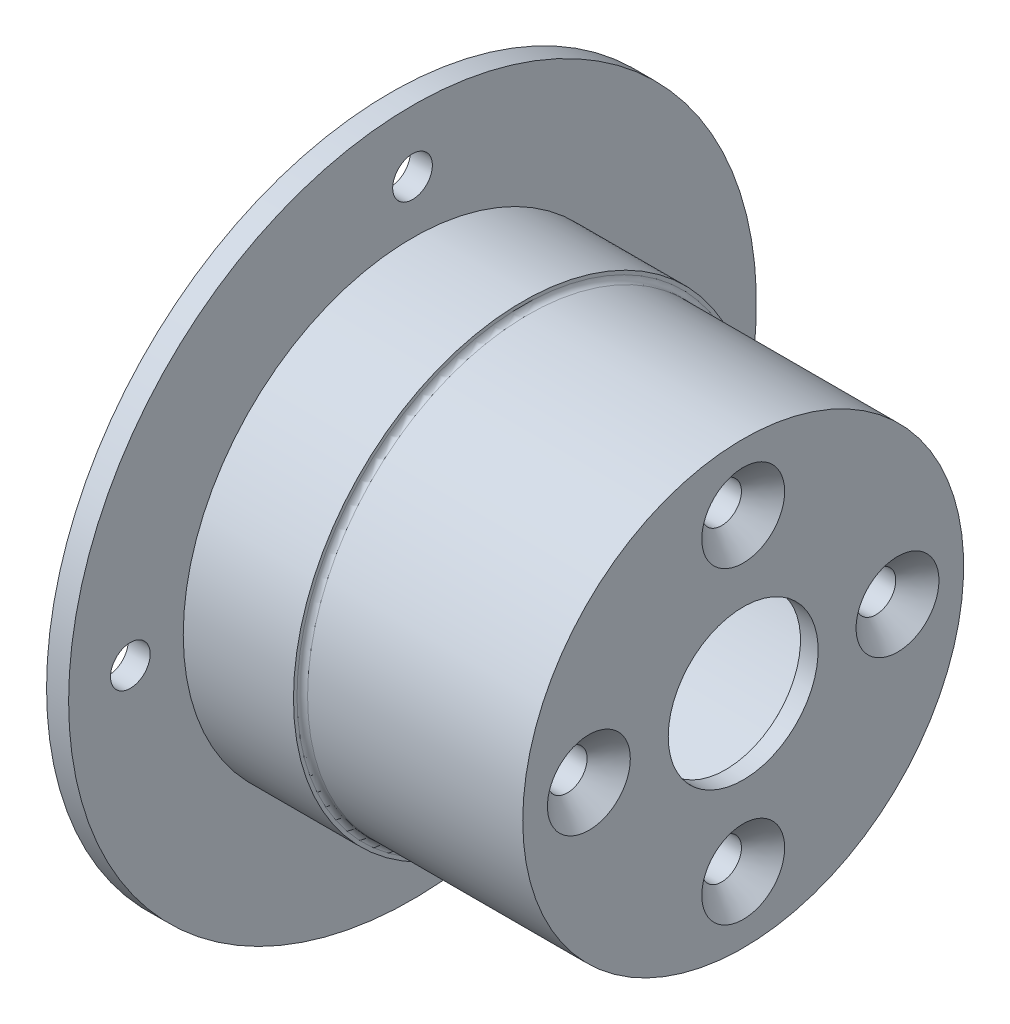
ISO-10303-21;
HEADER;
FILE_DESCRIPTION(('STEP AP214'),'2;1');
FILE_NAME('part.step','',(''),(''),'','','');
FILE_SCHEMA(('AUTOMOTIVE_DESIGN { 1 0 10303 214 1 1 1 1 }'));
ENDSEC;
DATA;
#1=APPLICATION_CONTEXT('core data for automotive mechanical design processes');
#2=APPLICATION_PROTOCOL_DEFINITION('international standard','automotive_design',2000,#1);
#3=PRODUCT_CONTEXT('',#1,'mechanical');
#4=PRODUCT('Part','Part','',(#3));
#5=PRODUCT_RELATED_PRODUCT_CATEGORY('part','',(#4));
#6=PRODUCT_DEFINITION_FORMATION('','',#4);
#7=PRODUCT_DEFINITION_CONTEXT('part definition',#1,'design');
#8=PRODUCT_DEFINITION('design','',#6,#7);
#9=PRODUCT_DEFINITION_SHAPE('','',#8);
#10=(LENGTH_UNIT() NAMED_UNIT(*) SI_UNIT(.MILLI.,.METRE.));
#11=(NAMED_UNIT(*) PLANE_ANGLE_UNIT() SI_UNIT($,.RADIAN.));
#12=(NAMED_UNIT(*) SI_UNIT($,.STERADIAN.) SOLID_ANGLE_UNIT());
#13=UNCERTAINTY_MEASURE_WITH_UNIT(LENGTH_MEASURE(1.E-05),#10,'distance_accuracy_value','');
#14=(GEOMETRIC_REPRESENTATION_CONTEXT(3) GLOBAL_UNCERTAINTY_ASSIGNED_CONTEXT((#13)) GLOBAL_UNIT_ASSIGNED_CONTEXT((#10,
#11,#12)) REPRESENTATION_CONTEXT('',''));
#15=CARTESIAN_POINT('',(0.,0.,0.));
#16=DIRECTION('',(0.,0.,1.));
#17=DIRECTION('',(1.,0.,0.));
#18=AXIS2_PLACEMENT_3D('',#15,#16,#17);
#19=CARTESIAN_POINT('',(0.,39.,0.));
#20=DIRECTION('',(1.,0.,0.));
#21=DIRECTION('',(0.,0.,-1.));
#22=AXIS2_PLACEMENT_3D('',#19,#20,#21);
#23=PLANE('',#22);
#24=CARTESIAN_POINT('',(0.,-32.,0.));
#25=DIRECTION('',(-1.,0.,0.));
#26=DIRECTION('',(0.,0.,1.));
#27=AXIS2_PLACEMENT_3D('',#24,#25,#26);
#28=CIRCLE('',#27,2.25);
#29=CARTESIAN_POINT('',(0.,-32.,2.25));
#30=VERTEX_POINT('',#29);
#31=EDGE_CURVE('E170',#30,#30,#28,.T.);
#32=ORIENTED_EDGE('',*,*,#31,.F.);
#33=EDGE_LOOP('',(#32));
#34=FACE_BOUND('',#33,.T.);
#35=CARTESIAN_POINT('',(0.,0.,32.));
#36=DIRECTION('',(-1.,0.,0.));
#37=DIRECTION('',(0.,0.,1.));
#38=AXIS2_PLACEMENT_3D('',#35,#36,#37);
#39=CIRCLE('',#38,2.25);
#40=CARTESIAN_POINT('',(0.,0.,34.25));
#41=VERTEX_POINT('',#40);
#42=EDGE_CURVE('E163',#41,#41,#39,.T.);
#43=ORIENTED_EDGE('',*,*,#42,.F.);
#44=EDGE_LOOP('',(#43));
#45=FACE_BOUND('',#44,.T.);
#46=CARTESIAN_POINT('',(0.,0.,-32.));
#47=DIRECTION('',(-1.,0.,0.));
#48=DIRECTION('',(0.,0.,1.));
#49=AXIS2_PLACEMENT_3D('',#46,#47,#48);
#50=CIRCLE('',#49,2.25);
#51=CARTESIAN_POINT('',(0.,0.,-29.75));
#52=VERTEX_POINT('',#51);
#53=EDGE_CURVE('E155',#52,#52,#50,.T.);
#54=ORIENTED_EDGE('',*,*,#53,.F.);
#55=EDGE_LOOP('',(#54));
#56=FACE_BOUND('',#55,.T.);
#57=CARTESIAN_POINT('',(0.,0.,0.));
#58=DIRECTION('',(-1.,0.,0.));
#59=DIRECTION('',(0.,0.,1.));
#60=AXIS2_PLACEMENT_3D('',#57,#58,#59);
#61=CIRCLE('',#60,21.);
#62=CARTESIAN_POINT('',(0.,0.,21.));
#63=VERTEX_POINT('',#62);
#64=EDGE_CURVE('E55',#63,#63,#61,.T.);
#65=ORIENTED_EDGE('',*,*,#64,.F.);
#66=EDGE_LOOP('',(#65));
#67=FACE_BOUND('',#66,.T.);
#68=CARTESIAN_POINT('',(0.,0.,0.));
#69=DIRECTION('',(-1.,0.,0.));
#70=DIRECTION('',(0.,0.,1.));
#71=AXIS2_PLACEMENT_3D('',#68,#69,#70);
#72=CIRCLE('',#71,39.);
#73=CARTESIAN_POINT('',(0.,0.,39.));
#74=VERTEX_POINT('',#73);
#75=EDGE_CURVE('E99',#74,#74,#72,.T.);
#76=ORIENTED_EDGE('',*,*,#75,.T.);
#77=EDGE_LOOP('',(#76));
#78=FACE_BOUND('',#77,.T.);
#79=CARTESIAN_POINT('',(0.,32.,0.));
#80=DIRECTION('',(-1.,0.,0.));
#81=DIRECTION('',(0.,0.,1.));
#82=AXIS2_PLACEMENT_3D('',#79,#80,#81);
#83=CIRCLE('',#82,2.25);
#84=CARTESIAN_POINT('',(0.,32.,2.25));
#85=VERTEX_POINT('',#84);
#86=EDGE_CURVE('E176',#85,#85,#83,.T.);
#87=ORIENTED_EDGE('',*,*,#86,.F.);
#88=EDGE_LOOP('',(#87));
#89=FACE_BOUND('',#88,.T.);
#90=ADVANCED_FACE('F40',(#34,#45,#56,#67,#78,#89),#23,.F.);
#91=CARTESIAN_POINT('',(-64.1033524540557,0.,0.));
#92=DIRECTION('',(-1.,0.,0.));
#93=DIRECTION('',(0.,0.,1.));
#94=AXIS2_PLACEMENT_3D('',#91,#92,#93);
#95=CYLINDRICAL_SURFACE('',#94,21.);
#96=CARTESIAN_POINT('',(35.,0.,0.));
#97=DIRECTION('',(-1.,0.,0.));
#98=DIRECTION('',(0.,0.,1.));
#99=AXIS2_PLACEMENT_3D('',#96,#97,#98);
#100=CIRCLE('',#99,21.);
#101=CARTESIAN_POINT('',(35.,0.,21.));
#102=VERTEX_POINT('',#101);
#103=EDGE_CURVE('E62',#102,#102,#100,.T.);
#104=ORIENTED_EDGE('',*,*,#103,.F.);
#105=EDGE_LOOP('',(#104));
#106=FACE_BOUND('',#105,.T.);
#107=ORIENTED_EDGE('',*,*,#64,.T.);
#108=EDGE_LOOP('',(#107));
#109=FACE_BOUND('',#108,.T.);
#110=ADVANCED_FACE('F184',(#106,#109),#95,.F.);
#111=CARTESIAN_POINT('',(35.,21.,0.));
#112=DIRECTION('',(1.,0.,0.));
#113=DIRECTION('',(0.,0.,-1.));
#114=AXIS2_PLACEMENT_3D('',#111,#112,#113);
#115=PLANE('',#114);
#116=CARTESIAN_POINT('',(35.,17.5,0.));
#117=DIRECTION('',(1.,0.,0.));
#118=DIRECTION('',(0.,0.,-1.));
#119=AXIS2_PLACEMENT_3D('',#116,#117,#118);
#120=CIRCLE('',#119,2.24999999999999);
#121=CARTESIAN_POINT('',(35.,17.5,-2.24999999999999));
#122=VERTEX_POINT('',#121);
#123=EDGE_CURVE('E139',#122,#122,#120,.T.);
#124=ORIENTED_EDGE('',*,*,#123,.T.);
#125=EDGE_LOOP('',(#124));
#126=FACE_BOUND('',#125,.T.);
#127=CARTESIAN_POINT('',(35.,0.,-17.5));
#128=DIRECTION('',(1.,0.,0.));
#129=DIRECTION('',(0.,0.,-1.));
#130=AXIS2_PLACEMENT_3D('',#127,#128,#129);
#131=CIRCLE('',#130,2.24999999999999);
#132=CARTESIAN_POINT('',(35.,0.,-19.75));
#133=VERTEX_POINT('',#132);
#134=EDGE_CURVE('E127',#133,#133,#131,.T.);
#135=ORIENTED_EDGE('',*,*,#134,.T.);
#136=EDGE_LOOP('',(#135));
#137=FACE_BOUND('',#136,.T.);
#138=CARTESIAN_POINT('',(35.,-17.5,0.));
#139=DIRECTION('',(1.,0.,0.));
#140=DIRECTION('',(0.,0.,-1.));
#141=AXIS2_PLACEMENT_3D('',#138,#139,#140);
#142=CIRCLE('',#141,2.24999999999999);
#143=CARTESIAN_POINT('',(35.,-17.5,-2.24999999999999));
#144=VERTEX_POINT('',#143);
#145=EDGE_CURVE('E115',#144,#144,#142,.T.);
#146=ORIENTED_EDGE('',*,*,#145,.T.);
#147=EDGE_LOOP('',(#146));
#148=FACE_BOUND('',#147,.T.);
#149=CARTESIAN_POINT('',(35.,0.,17.5));
#150=DIRECTION('',(1.,0.,0.));
#151=DIRECTION('',(0.,0.,-1.));
#152=AXIS2_PLACEMENT_3D('',#149,#150,#151);
#153=CIRCLE('',#152,2.24999999999999);
#154=CARTESIAN_POINT('',(35.,0.,15.25));
#155=VERTEX_POINT('',#154);
#156=EDGE_CURVE('E103',#155,#155,#153,.T.);
#157=ORIENTED_EDGE('',*,*,#156,.T.);
#158=EDGE_LOOP('',(#157));
#159=FACE_BOUND('',#158,.T.);
#160=CARTESIAN_POINT('',(35.,0.,0.));
#161=DIRECTION('',(-1.,0.,0.));
#162=DIRECTION('',(0.,0.,1.));
#163=AXIS2_PLACEMENT_3D('',#160,#161,#162);
#164=CIRCLE('',#163,12.75);
#165=CARTESIAN_POINT('',(35.,0.,12.75));
#166=VERTEX_POINT('',#165);
#167=EDGE_CURVE('E68',#166,#166,#164,.T.);
#168=ORIENTED_EDGE('',*,*,#167,.F.);
#169=EDGE_LOOP('',(#168));
#170=FACE_BOUND('',#169,.T.);
#171=ORIENTED_EDGE('',*,*,#103,.T.);
#172=EDGE_LOOP('',(#171));
#173=FACE_BOUND('',#172,.T.);
#174=ADVANCED_FACE('F190',(#126,#137,#148,#159,#170,#173),#115,.F.);
#175=CARTESIAN_POINT('',(-64.1033524540557,0.,0.));
#176=DIRECTION('',(-1.,0.,0.));
#177=DIRECTION('',(0.,0.,1.));
#178=AXIS2_PLACEMENT_3D('',#175,#176,#177);
#179=CYLINDRICAL_SURFACE('',#178,12.75);
#180=CARTESIAN_POINT('',(38.,0.,0.));
#181=DIRECTION('',(-1.,0.,0.));
#182=DIRECTION('',(0.,0.,1.));
#183=AXIS2_PLACEMENT_3D('',#180,#181,#182);
#184=CIRCLE('',#183,12.75);
#185=CARTESIAN_POINT('',(38.,0.,12.75));
#186=VERTEX_POINT('',#185);
#187=EDGE_CURVE('E72',#186,#186,#184,.T.);
#188=ORIENTED_EDGE('',*,*,#187,.F.);
#189=EDGE_LOOP('',(#188));
#190=FACE_BOUND('',#189,.T.);
#191=ORIENTED_EDGE('',*,*,#167,.T.);
#192=EDGE_LOOP('',(#191));
#193=FACE_BOUND('',#192,.T.);
#194=ADVANCED_FACE('F227',(#190,#193),#179,.F.);
#195=CARTESIAN_POINT('',(38.,12.75,0.));
#196=DIRECTION('',(1.,0.,0.));
#197=DIRECTION('',(0.,0.,-1.));
#198=AXIS2_PLACEMENT_3D('',#195,#196,#197);
#199=PLANE('',#198);
#200=CARTESIAN_POINT('',(38.,0.,0.));
#201=DIRECTION('',(-1.,0.,0.));
#202=DIRECTION('',(0.,0.,1.));
#203=AXIS2_PLACEMENT_3D('',#200,#201,#202);
#204=CIRCLE('',#203,8.5);
#205=CARTESIAN_POINT('',(38.,0.,8.5));
#206=VERTEX_POINT('',#205);
#207=EDGE_CURVE('E76',#206,#206,#204,.T.);
#208=ORIENTED_EDGE('',*,*,#207,.F.);
#209=EDGE_LOOP('',(#208));
#210=FACE_BOUND('',#209,.T.);
#211=ORIENTED_EDGE('',*,*,#187,.T.);
#212=EDGE_LOOP('',(#211));
#213=FACE_BOUND('',#212,.T.);
#214=ADVANCED_FACE('F223',(#210,#213),#199,.F.);
#215=CARTESIAN_POINT('',(-64.1033524540557,0.,0.));
#216=DIRECTION('',(-1.,0.,0.));
#217=DIRECTION('',(0.,0.,1.));
#218=AXIS2_PLACEMENT_3D('',#215,#216,#217);
#219=CYLINDRICAL_SURFACE('',#218,8.5);
#220=CARTESIAN_POINT('',(40.,0.,0.));
#221=DIRECTION('',(-1.,0.,0.));
#222=DIRECTION('',(0.,0.,1.));
#223=AXIS2_PLACEMENT_3D('',#220,#221,#222);
#224=CIRCLE('',#223,8.5);
#225=CARTESIAN_POINT('',(40.,0.,8.5));
#226=VERTEX_POINT('',#225);
#227=EDGE_CURVE('E79',#226,#226,#224,.T.);
#228=ORIENTED_EDGE('',*,*,#227,.F.);
#229=EDGE_LOOP('',(#228));
#230=FACE_BOUND('',#229,.T.);
#231=ORIENTED_EDGE('',*,*,#207,.T.);
#232=EDGE_LOOP('',(#231));
#233=FACE_BOUND('',#232,.T.);
#234=ADVANCED_FACE('F219',(#230,#233),#219,.F.);
#235=CARTESIAN_POINT('',(40.,8.5,0.));
#236=DIRECTION('',(-1.,0.,0.));
#237=DIRECTION('',(0.,0.,1.));
#238=AXIS2_PLACEMENT_3D('',#235,#236,#237);
#239=PLANE('',#238);
#240=CARTESIAN_POINT('',(40.,17.5,0.));
#241=DIRECTION('',(1.,0.,0.));
#242=DIRECTION('',(0.,0.,-1.));
#243=AXIS2_PLACEMENT_3D('',#240,#241,#242);
#244=CIRCLE('',#243,4.7);
#245=CARTESIAN_POINT('',(40.,17.5,-4.7));
#246=VERTEX_POINT('',#245);
#247=EDGE_CURVE('E147',#246,#246,#244,.T.);
#248=ORIENTED_EDGE('',*,*,#247,.F.);
#249=EDGE_LOOP('',(#248));
#250=FACE_BOUND('',#249,.T.);
#251=CARTESIAN_POINT('',(40.,0.,-17.5));
#252=DIRECTION('',(1.,0.,0.));
#253=DIRECTION('',(0.,0.,-1.));
#254=AXIS2_PLACEMENT_3D('',#251,#252,#253);
#255=CIRCLE('',#254,4.7);
#256=CARTESIAN_POINT('',(40.,0.,-22.2));
#257=VERTEX_POINT('',#256);
#258=EDGE_CURVE('E135',#257,#257,#255,.T.);
#259=ORIENTED_EDGE('',*,*,#258,.F.);
#260=EDGE_LOOP('',(#259));
#261=FACE_BOUND('',#260,.T.);
#262=CARTESIAN_POINT('',(40.,-17.5,0.));
#263=DIRECTION('',(1.,0.,0.));
#264=DIRECTION('',(0.,0.,-1.));
#265=AXIS2_PLACEMENT_3D('',#262,#263,#264);
#266=CIRCLE('',#265,4.7);
#267=CARTESIAN_POINT('',(40.,-17.5,-4.7));
#268=VERTEX_POINT('',#267);
#269=EDGE_CURVE('E123',#268,#268,#266,.T.);
#270=ORIENTED_EDGE('',*,*,#269,.F.);
#271=EDGE_LOOP('',(#270));
#272=FACE_BOUND('',#271,.T.);
#273=CARTESIAN_POINT('',(40.,0.,17.5));
#274=DIRECTION('',(1.,0.,0.));
#275=DIRECTION('',(0.,0.,-1.));
#276=AXIS2_PLACEMENT_3D('',#273,#274,#275);
#277=CIRCLE('',#276,4.7);
#278=CARTESIAN_POINT('',(40.,0.,12.8));
#279=VERTEX_POINT('',#278);
#280=EDGE_CURVE('E111',#279,#279,#277,.T.);
#281=ORIENTED_EDGE('',*,*,#280,.F.);
#282=EDGE_LOOP('',(#281));
#283=FACE_BOUND('',#282,.T.);
#284=CARTESIAN_POINT('',(40.,0.,0.));
#285=DIRECTION('',(-1.,0.,0.));
#286=DIRECTION('',(0.,0.,1.));
#287=AXIS2_PLACEMENT_3D('',#284,#285,#286);
#288=CIRCLE('',#287,25.);
#289=CARTESIAN_POINT('',(40.,0.,25.));
#290=VERTEX_POINT('',#289);
#291=EDGE_CURVE('E83',#290,#290,#288,.T.);
#292=ORIENTED_EDGE('',*,*,#291,.F.);
#293=EDGE_LOOP('',(#292));
#294=FACE_BOUND('',#293,.T.);
#295=ORIENTED_EDGE('',*,*,#227,.T.);
#296=EDGE_LOOP('',(#295));
#297=FACE_BOUND('',#296,.T.);
#298=ADVANCED_FACE('F216',(#250,#261,#272,#283,#294,#297),#239,.F.);
#299=CARTESIAN_POINT('',(-64.1033524540557,0.,0.));
#300=DIRECTION('',(-1.,0.,0.));
#301=DIRECTION('',(0.,0.,1.));
#302=AXIS2_PLACEMENT_3D('',#299,#300,#301);
#303=CYLINDRICAL_SURFACE('',#302,25.);
#304=CARTESIAN_POINT('',(15.6,0.,0.));
#305=DIRECTION('',(-1.,0.,0.));
#306=DIRECTION('',(0.,0.,1.));
#307=AXIS2_PLACEMENT_3D('',#304,#305,#306);
#308=CIRCLE('',#307,25.);
#309=CARTESIAN_POINT('',(15.6,0.,25.));
#310=VERTEX_POINT('',#309);
#311=EDGE_CURVE('E10',#310,#310,#308,.F.);
#312=ORIENTED_EDGE('',*,*,#311,.T.);
#313=EDGE_LOOP('',(#312));
#314=FACE_BOUND('',#313,.T.);
#315=ORIENTED_EDGE('',*,*,#291,.T.);
#316=EDGE_LOOP('',(#315));
#317=FACE_BOUND('',#316,.T.);
#318=ADVANCED_FACE('F213',(#314,#317),#303,.T.);
#319=CARTESIAN_POINT('',(15.,25.,0.));
#320=DIRECTION('',(-1.,0.,0.));
#321=DIRECTION('',(0.,0.,1.));
#322=AXIS2_PLACEMENT_3D('',#319,#320,#321);
#323=PLANE('',#322);
#324=CARTESIAN_POINT('',(15.,0.,0.));
#325=DIRECTION('',(-1.,0.,0.));
#326=DIRECTION('',(0.,0.,1.));
#327=AXIS2_PLACEMENT_3D('',#324,#325,#326);
#328=CIRCLE('',#327,25.6);
#329=CARTESIAN_POINT('',(15.,0.,25.6));
#330=VERTEX_POINT('',#329);
#331=EDGE_CURVE('E48',#330,#330,#328,.T.);
#332=ORIENTED_EDGE('',*,*,#331,.T.);
#333=EDGE_LOOP('',(#332));
#334=FACE_BOUND('',#333,.T.);
#335=CARTESIAN_POINT('',(15.,0.,0.));
#336=DIRECTION('',(-1.,0.,0.));
#337=DIRECTION('',(0.,0.,1.));
#338=AXIS2_PLACEMENT_3D('',#335,#336,#337);
#339=CIRCLE('',#338,26.);
#340=CARTESIAN_POINT('',(15.,0.,26.));
#341=VERTEX_POINT('',#340);
#342=EDGE_CURVE('E87',#341,#341,#339,.T.);
#343=ORIENTED_EDGE('',*,*,#342,.F.);
#344=EDGE_LOOP('',(#343));
#345=FACE_BOUND('',#344,.T.);
#346=ADVANCED_FACE('F209',(#334,#345),#323,.F.);
#347=CARTESIAN_POINT('',(-64.1033524540557,0.,0.));
#348=DIRECTION('',(-1.,0.,0.));
#349=DIRECTION('',(0.,0.,1.));
#350=AXIS2_PLACEMENT_3D('',#347,#348,#349);
#351=CYLINDRICAL_SURFACE('',#350,26.);
#352=CARTESIAN_POINT('',(2.5,0.,0.));
#353=DIRECTION('',(-1.,0.,0.));
#354=DIRECTION('',(0.,0.,1.));
#355=AXIS2_PLACEMENT_3D('',#352,#353,#354);
#356=CIRCLE('',#355,26.);
#357=CARTESIAN_POINT('',(2.5,0.,26.));
#358=VERTEX_POINT('',#357);
#359=EDGE_CURVE('E91',#358,#358,#356,.T.);
#360=ORIENTED_EDGE('',*,*,#359,.F.);
#361=EDGE_LOOP('',(#360));
#362=FACE_BOUND('',#361,.T.);
#363=ORIENTED_EDGE('',*,*,#342,.T.);
#364=EDGE_LOOP('',(#363));
#365=FACE_BOUND('',#364,.T.);
#366=ADVANCED_FACE('F205',(#362,#365),#351,.T.);
#367=CARTESIAN_POINT('',(2.5,26.,0.));
#368=DIRECTION('',(-1.,0.,0.));
#369=DIRECTION('',(0.,0.,1.));
#370=AXIS2_PLACEMENT_3D('',#367,#368,#369);
#371=PLANE('',#370);
#372=CARTESIAN_POINT('',(2.5,32.,0.));
#373=DIRECTION('',(-1.,0.,0.));
#374=DIRECTION('',(0.,0.,1.));
#375=AXIS2_PLACEMENT_3D('',#372,#373,#374);
#376=CIRCLE('',#375,2.25);
#377=CARTESIAN_POINT('',(2.5,32.,2.25));
#378=VERTEX_POINT('',#377);
#379=EDGE_CURVE('E173',#378,#378,#376,.T.);
#380=ORIENTED_EDGE('',*,*,#379,.T.);
#381=EDGE_LOOP('',(#380));
#382=FACE_BOUND('',#381,.T.);
#383=CARTESIAN_POINT('',(2.5,-32.,0.));
#384=DIRECTION('',(-1.,0.,0.));
#385=DIRECTION('',(0.,0.,1.));
#386=AXIS2_PLACEMENT_3D('',#383,#384,#385);
#387=CIRCLE('',#386,2.25);
#388=CARTESIAN_POINT('',(2.5,-32.,2.25));
#389=VERTEX_POINT('',#388);
#390=EDGE_CURVE('E166',#389,#389,#387,.T.);
#391=ORIENTED_EDGE('',*,*,#390,.T.);
#392=EDGE_LOOP('',(#391));
#393=FACE_BOUND('',#392,.T.);
#394=CARTESIAN_POINT('',(2.5,0.,32.));
#395=DIRECTION('',(-1.,0.,0.));
#396=DIRECTION('',(0.,0.,1.));
#397=AXIS2_PLACEMENT_3D('',#394,#395,#396);
#398=CIRCLE('',#397,2.25);
#399=CARTESIAN_POINT('',(2.5,0.,34.25));
#400=VERTEX_POINT('',#399);
#401=EDGE_CURVE('E159',#400,#400,#398,.T.);
#402=ORIENTED_EDGE('',*,*,#401,.T.);
#403=EDGE_LOOP('',(#402));
#404=FACE_BOUND('',#403,.T.);
#405=CARTESIAN_POINT('',(2.5,0.,-32.));
#406=DIRECTION('',(-1.,0.,0.));
#407=DIRECTION('',(0.,0.,1.));
#408=AXIS2_PLACEMENT_3D('',#405,#406,#407);
#409=CIRCLE('',#408,2.25);
#410=CARTESIAN_POINT('',(2.5,0.,-29.75));
#411=VERTEX_POINT('',#410);
#412=EDGE_CURVE('E151',#411,#411,#409,.T.);
#413=ORIENTED_EDGE('',*,*,#412,.T.);
#414=EDGE_LOOP('',(#413));
#415=FACE_BOUND('',#414,.T.);
#416=CARTESIAN_POINT('',(2.5,0.,0.));
#417=DIRECTION('',(-1.,0.,0.));
#418=DIRECTION('',(0.,0.,1.));
#419=AXIS2_PLACEMENT_3D('',#416,#417,#418);
#420=CIRCLE('',#419,39.);
#421=CARTESIAN_POINT('',(2.5,0.,39.));
#422=VERTEX_POINT('',#421);
#423=EDGE_CURVE('E95',#422,#422,#420,.T.);
#424=ORIENTED_EDGE('',*,*,#423,.F.);
#425=EDGE_LOOP('',(#424));
#426=FACE_BOUND('',#425,.T.);
#427=ORIENTED_EDGE('',*,*,#359,.T.);
#428=EDGE_LOOP('',(#427));
#429=FACE_BOUND('',#428,.T.);
#430=ADVANCED_FACE('F201',(#382,#393,#404,#415,#426,#429),#371,.F.);
#431=CARTESIAN_POINT('',(-64.1033524540557,0.,0.));
#432=DIRECTION('',(-1.,0.,0.));
#433=DIRECTION('',(0.,0.,1.));
#434=AXIS2_PLACEMENT_3D('',#431,#432,#433);
#435=CYLINDRICAL_SURFACE('',#434,39.);
#436=ORIENTED_EDGE('',*,*,#75,.F.);
#437=EDGE_LOOP('',(#436));
#438=FACE_BOUND('',#437,.T.);
#439=ORIENTED_EDGE('',*,*,#423,.T.);
#440=EDGE_LOOP('',(#439));
#441=FACE_BOUND('',#440,.T.);
#442=ADVANCED_FACE('F198',(#438,#441),#435,.T.);
#443=CARTESIAN_POINT('',(40.,0.,17.5));
#444=DIRECTION('',(1.,0.,0.));
#445=DIRECTION('',(0.,0.,-1.));
#446=AXIS2_PLACEMENT_3D('',#443,#444,#445);
#447=CYLINDRICAL_SURFACE('',#446,2.24999999999999);
#448=ORIENTED_EDGE('',*,*,#156,.F.);
#449=EDGE_LOOP('',(#448));
#450=FACE_BOUND('',#449,.T.);
#451=CARTESIAN_POINT('',(37.55,0.,17.5));
#452=DIRECTION('',(1.,0.,0.));
#453=DIRECTION('',(0.,0.,-1.));
#454=AXIS2_PLACEMENT_3D('',#451,#452,#453);
#455=CIRCLE('',#454,2.24999999999999);
#456=CARTESIAN_POINT('',(37.55,0.,15.25));
#457=VERTEX_POINT('',#456);
#458=EDGE_CURVE('E107',#457,#457,#455,.T.);
#459=ORIENTED_EDGE('',*,*,#458,.T.);
#460=EDGE_LOOP('',(#459));
#461=FACE_BOUND('',#460,.T.);
#462=ADVANCED_FACE('F196',(#450,#461),#447,.F.);
#463=CARTESIAN_POINT('',(40.,0.,17.5));
#464=DIRECTION('',(1.,0.,0.));
#465=DIRECTION('',(0.,0.,-1.));
#466=AXIS2_PLACEMENT_3D('',#463,#464,#465);
#467=CONICAL_SURFACE('',#466,4.7,0.785398163397449);
#468=ORIENTED_EDGE('',*,*,#458,.F.);
#469=EDGE_LOOP('',(#468));
#470=FACE_BOUND('',#469,.T.);
#471=ORIENTED_EDGE('',*,*,#280,.T.);
#472=EDGE_LOOP('',(#471));
#473=FACE_BOUND('',#472,.T.);
#474=ADVANCED_FACE('F264',(#470,#473),#467,.F.);
#475=CARTESIAN_POINT('',(40.,-17.5,0.));
#476=DIRECTION('',(1.,0.,0.));
#477=DIRECTION('',(0.,0.,-1.));
#478=AXIS2_PLACEMENT_3D('',#475,#476,#477);
#479=CYLINDRICAL_SURFACE('',#478,2.24999999999999);
#480=ORIENTED_EDGE('',*,*,#145,.F.);
#481=EDGE_LOOP('',(#480));
#482=FACE_BOUND('',#481,.T.);
#483=CARTESIAN_POINT('',(37.55,-17.5,0.));
#484=DIRECTION('',(1.,0.,0.));
#485=DIRECTION('',(0.,0.,-1.));
#486=AXIS2_PLACEMENT_3D('',#483,#484,#485);
#487=CIRCLE('',#486,2.24999999999999);
#488=CARTESIAN_POINT('',(37.55,-17.5,-2.24999999999999));
#489=VERTEX_POINT('',#488);
#490=EDGE_CURVE('E119',#489,#489,#487,.T.);
#491=ORIENTED_EDGE('',*,*,#490,.T.);
#492=EDGE_LOOP('',(#491));
#493=FACE_BOUND('',#492,.T.);
#494=ADVANCED_FACE('F269',(#482,#493),#479,.F.);
#495=CARTESIAN_POINT('',(40.,-17.5,0.));
#496=DIRECTION('',(1.,0.,0.));
#497=DIRECTION('',(0.,0.,-1.));
#498=AXIS2_PLACEMENT_3D('',#495,#496,#497);
#499=CONICAL_SURFACE('',#498,4.7,0.785398163397449);
#500=ORIENTED_EDGE('',*,*,#490,.F.);
#501=EDGE_LOOP('',(#500));
#502=FACE_BOUND('',#501,.T.);
#503=ORIENTED_EDGE('',*,*,#269,.T.);
#504=EDGE_LOOP('',(#503));
#505=FACE_BOUND('',#504,.T.);
#506=ADVANCED_FACE('F284',(#502,#505),#499,.F.);
#507=CARTESIAN_POINT('',(40.,0.,-17.5));
#508=DIRECTION('',(1.,0.,0.));
#509=DIRECTION('',(0.,0.,-1.));
#510=AXIS2_PLACEMENT_3D('',#507,#508,#509);
#511=CYLINDRICAL_SURFACE('',#510,2.24999999999999);
#512=ORIENTED_EDGE('',*,*,#134,.F.);
#513=EDGE_LOOP('',(#512));
#514=FACE_BOUND('',#513,.T.);
#515=CARTESIAN_POINT('',(37.55,0.,-17.5));
#516=DIRECTION('',(1.,0.,0.));
#517=DIRECTION('',(0.,0.,-1.));
#518=AXIS2_PLACEMENT_3D('',#515,#516,#517);
#519=CIRCLE('',#518,2.24999999999999);
#520=CARTESIAN_POINT('',(37.55,0.,-19.75));
#521=VERTEX_POINT('',#520);
#522=EDGE_CURVE('E131',#521,#521,#519,.T.);
#523=ORIENTED_EDGE('',*,*,#522,.T.);
#524=EDGE_LOOP('',(#523));
#525=FACE_BOUND('',#524,.T.);
#526=ADVANCED_FACE('F290',(#514,#525),#511,.F.);
#527=CARTESIAN_POINT('',(40.,0.,-17.5));
#528=DIRECTION('',(1.,0.,0.));
#529=DIRECTION('',(0.,0.,-1.));
#530=AXIS2_PLACEMENT_3D('',#527,#528,#529);
#531=CONICAL_SURFACE('',#530,4.7,0.785398163397449);
#532=ORIENTED_EDGE('',*,*,#522,.F.);
#533=EDGE_LOOP('',(#532));
#534=FACE_BOUND('',#533,.T.);
#535=ORIENTED_EDGE('',*,*,#258,.T.);
#536=EDGE_LOOP('',(#535));
#537=FACE_BOUND('',#536,.T.);
#538=ADVANCED_FACE('F294',(#534,#537),#531,.F.);
#539=CARTESIAN_POINT('',(40.,17.5,0.));
#540=DIRECTION('',(1.,0.,0.));
#541=DIRECTION('',(0.,0.,-1.));
#542=AXIS2_PLACEMENT_3D('',#539,#540,#541);
#543=CYLINDRICAL_SURFACE('',#542,2.24999999999999);
#544=ORIENTED_EDGE('',*,*,#123,.F.);
#545=EDGE_LOOP('',(#544));
#546=FACE_BOUND('',#545,.T.);
#547=CARTESIAN_POINT('',(37.55,17.5,0.));
#548=DIRECTION('',(1.,0.,0.));
#549=DIRECTION('',(0.,0.,-1.));
#550=AXIS2_PLACEMENT_3D('',#547,#548,#549);
#551=CIRCLE('',#550,2.24999999999999);
#552=CARTESIAN_POINT('',(37.55,17.5,-2.24999999999999));
#553=VERTEX_POINT('',#552);
#554=EDGE_CURVE('E143',#553,#553,#551,.T.);
#555=ORIENTED_EDGE('',*,*,#554,.T.);
#556=EDGE_LOOP('',(#555));
#557=FACE_BOUND('',#556,.T.);
#558=ADVANCED_FACE('F298',(#546,#557),#543,.F.);
#559=CARTESIAN_POINT('',(40.,17.5,0.));
#560=DIRECTION('',(1.,0.,0.));
#561=DIRECTION('',(0.,0.,-1.));
#562=AXIS2_PLACEMENT_3D('',#559,#560,#561);
#563=CONICAL_SURFACE('',#562,4.7,0.785398163397449);
#564=ORIENTED_EDGE('',*,*,#554,.F.);
#565=EDGE_LOOP('',(#564));
#566=FACE_BOUND('',#565,.T.);
#567=ORIENTED_EDGE('',*,*,#247,.T.);
#568=EDGE_LOOP('',(#567));
#569=FACE_BOUND('',#568,.T.);
#570=ADVANCED_FACE('F302',(#566,#569),#563,.F.);
#571=CARTESIAN_POINT('',(15.6,0.,0.));
#572=DIRECTION('',(-1.,0.,0.));
#573=DIRECTION('',(0.,0.,1.));
#574=AXIS2_PLACEMENT_3D('',#571,#572,#573);
#575=TOROIDAL_SURFACE('',#574,25.6,0.6);
#576=ORIENTED_EDGE('',*,*,#311,.F.);
#577=EDGE_LOOP('',(#576));
#578=FACE_BOUND('',#577,.T.);
#579=ORIENTED_EDGE('',*,*,#331,.F.);
#580=EDGE_LOOP('',(#579));
#581=FACE_BOUND('',#580,.T.);
#582=ADVANCED_FACE('F42',(#578,#581),#575,.F.);
#583=CARTESIAN_POINT('',(0.,0.,-32.));
#584=DIRECTION('',(-1.,0.,0.));
#585=DIRECTION('',(0.,0.,1.));
#586=AXIS2_PLACEMENT_3D('',#583,#584,#585);
#587=CYLINDRICAL_SURFACE('',#586,2.25);
#588=ORIENTED_EDGE('',*,*,#412,.F.);
#589=EDGE_LOOP('',(#588));
#590=FACE_BOUND('',#589,.T.);
#591=ORIENTED_EDGE('',*,*,#53,.T.);
#592=EDGE_LOOP('',(#591));
#593=FACE_BOUND('',#592,.T.);
#594=ADVANCED_FACE('F307',(#590,#593),#587,.F.);
#595=CARTESIAN_POINT('',(0.,0.,32.));
#596=DIRECTION('',(-1.,0.,0.));
#597=DIRECTION('',(0.,0.,1.));
#598=AXIS2_PLACEMENT_3D('',#595,#596,#597);
#599=CYLINDRICAL_SURFACE('',#598,2.25);
#600=ORIENTED_EDGE('',*,*,#401,.F.);
#601=EDGE_LOOP('',(#600));
#602=FACE_BOUND('',#601,.T.);
#603=ORIENTED_EDGE('',*,*,#42,.T.);
#604=EDGE_LOOP('',(#603));
#605=FACE_BOUND('',#604,.T.);
#606=ADVANCED_FACE('F310',(#602,#605),#599,.F.);
#607=CARTESIAN_POINT('',(0.,-32.,0.));
#608=DIRECTION('',(-1.,0.,0.));
#609=DIRECTION('',(0.,0.,1.));
#610=AXIS2_PLACEMENT_3D('',#607,#608,#609);
#611=CYLINDRICAL_SURFACE('',#610,2.25);
#612=ORIENTED_EDGE('',*,*,#390,.F.);
#613=EDGE_LOOP('',(#612));
#614=FACE_BOUND('',#613,.T.);
#615=ORIENTED_EDGE('',*,*,#31,.T.);
#616=EDGE_LOOP('',(#615));
#617=FACE_BOUND('',#616,.T.);
#618=ADVANCED_FACE('F314',(#614,#617),#611,.F.);
#619=CARTESIAN_POINT('',(0.,32.,0.));
#620=DIRECTION('',(-1.,0.,0.));
#621=DIRECTION('',(0.,0.,1.));
#622=AXIS2_PLACEMENT_3D('',#619,#620,#621);
#623=CYLINDRICAL_SURFACE('',#622,2.25);
#624=ORIENTED_EDGE('',*,*,#379,.F.);
#625=EDGE_LOOP('',(#624));
#626=FACE_BOUND('',#625,.T.);
#627=ORIENTED_EDGE('',*,*,#86,.T.);
#628=EDGE_LOOP('',(#627));
#629=FACE_BOUND('',#628,.T.);
#630=ADVANCED_FACE('F181',(#626,#629),#623,.F.);
#631=CLOSED_SHELL('',(#90,#110,#174,#194,#214,#234,#298,#318,#346,#366,#430,#442,#462,#474,#494,
#506,#526,#538,#558,#570,#582,#594,#606,#618,#630));
#632=MANIFOLD_SOLID_BREP('B2',#631);
#633=ADVANCED_BREP_SHAPE_REPRESENTATION('',(#18,#632),#14);
#634=SHAPE_DEFINITION_REPRESENTATION(#9,#633);
ENDSEC;
END-ISO-10303-21;
